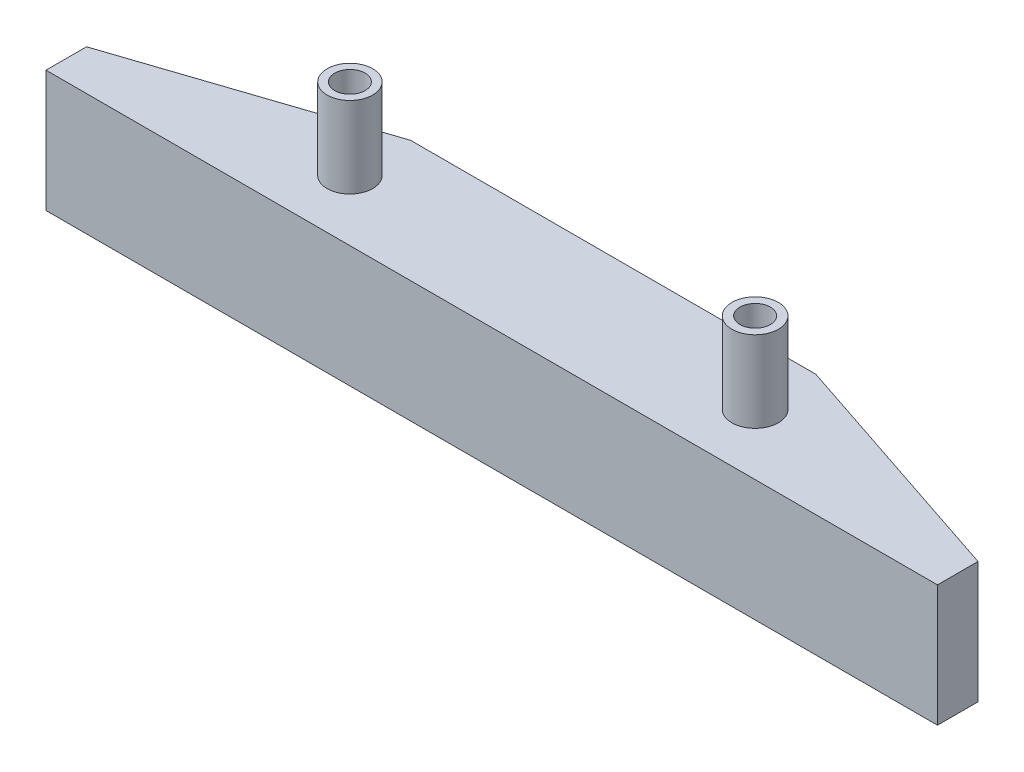
ISO-10303-21;
HEADER;
FILE_DESCRIPTION(('STEP AP214'),'2;1');
FILE_NAME('part.step','',(''),(''),'','','');
FILE_SCHEMA(('AUTOMOTIVE_DESIGN { 1 0 10303 214 1 1 1 1 }'));
ENDSEC;
DATA;
#1=APPLICATION_CONTEXT('core data for automotive mechanical design processes');
#2=APPLICATION_PROTOCOL_DEFINITION('international standard','automotive_design',2000,#1);
#3=PRODUCT_CONTEXT('',#1,'mechanical');
#4=PRODUCT('Part','Part','',(#3));
#5=PRODUCT_RELATED_PRODUCT_CATEGORY('part','',(#4));
#6=PRODUCT_DEFINITION_FORMATION('','',#4);
#7=PRODUCT_DEFINITION_CONTEXT('part definition',#1,'design');
#8=PRODUCT_DEFINITION('design','',#6,#7);
#9=PRODUCT_DEFINITION_SHAPE('','',#8);
#10=(LENGTH_UNIT() NAMED_UNIT(*) SI_UNIT(.MILLI.,.METRE.));
#11=(NAMED_UNIT(*) PLANE_ANGLE_UNIT() SI_UNIT($,.RADIAN.));
#12=(NAMED_UNIT(*) SI_UNIT($,.STERADIAN.) SOLID_ANGLE_UNIT());
#13=UNCERTAINTY_MEASURE_WITH_UNIT(LENGTH_MEASURE(1.E-05),#10,'distance_accuracy_value','');
#14=(GEOMETRIC_REPRESENTATION_CONTEXT(3) GLOBAL_UNCERTAINTY_ASSIGNED_CONTEXT((#13)) GLOBAL_UNIT_ASSIGNED_CONTEXT((#10,
#11,#12)) REPRESENTATION_CONTEXT('',''));
#15=CARTESIAN_POINT('',(0.,0.,0.));
#16=DIRECTION('',(0.,0.,1.));
#17=DIRECTION('',(1.,0.,0.));
#18=AXIS2_PLACEMENT_3D('',#15,#16,#17);
#19=CARTESIAN_POINT('',(0.,12.,0.));
#20=DIRECTION('',(0.,1.,0.));
#21=DIRECTION('',(0.,0.,1.));
#22=AXIS2_PLACEMENT_3D('',#19,#20,#21);
#23=PLANE('',#22);
#24=CARTESIAN_POINT('',(24.,12.,-5.99999999999996));
#25=DIRECTION('',(0.,1.,0.));
#26=DIRECTION('',(0.,0.,1.));
#27=AXIS2_PLACEMENT_3D('',#24,#25,#26);
#28=CIRCLE('',#27,2.25);
#29=CARTESIAN_POINT('',(24.,12.,-3.74999999999996));
#30=VERTEX_POINT('',#29);
#31=EDGE_CURVE('E234',#30,#30,#28,.T.);
#32=ORIENTED_EDGE('',*,*,#31,.F.);
#33=EDGE_LOOP('',(#32));
#34=FACE_BOUND('',#33,.T.);
#35=DIRECTION('',(0.,0.,1.));
#36=VECTOR('',#35,1.);
#37=CARTESIAN_POINT('',(0.,12.,-4.));
#38=LINE('',#37,#36);
#39=CARTESIAN_POINT('',(0.,12.,-4.));
#40=VERTEX_POINT('',#39);
#41=CARTESIAN_POINT('',(0.,12.,0.));
#42=VERTEX_POINT('',#41);
#43=EDGE_CURVE('E145',#40,#42,#38,.T.);
#44=ORIENTED_EDGE('',*,*,#43,.T.);
#45=DIRECTION('',(1.,0.,0.));
#46=VECTOR('',#45,1.);
#47=CARTESIAN_POINT('',(0.,12.,0.));
#48=LINE('',#47,#46);
#49=CARTESIAN_POINT('',(88.,12.,0.));
#50=VERTEX_POINT('',#49);
#51=EDGE_CURVE('E103',#42,#50,#48,.T.);
#52=ORIENTED_EDGE('',*,*,#51,.T.);
#53=DIRECTION('',(0.,0.,-1.));
#54=VECTOR('',#53,1.);
#55=CARTESIAN_POINT('',(88.,12.,0.));
#56=LINE('',#55,#54);
#57=CARTESIAN_POINT('',(88.,12.,-4.));
#58=VERTEX_POINT('',#57);
#59=EDGE_CURVE('E116',#50,#58,#56,.T.);
#60=ORIENTED_EDGE('',*,*,#59,.T.);
#61=DIRECTION('',(-0.948683298050514,0.,-0.316227766016838));
#62=VECTOR('',#61,1.);
#63=CARTESIAN_POINT('',(88.,12.,-4.));
#64=LINE('',#63,#62);
#65=CARTESIAN_POINT('',(64.,12.,-12.));
#66=VERTEX_POINT('',#65);
#67=EDGE_CURVE('E110',#58,#66,#64,.T.);
#68=ORIENTED_EDGE('',*,*,#67,.T.);
#69=DIRECTION('',(-1.,0.,0.));
#70=VECTOR('',#69,1.);
#71=CARTESIAN_POINT('',(64.,12.,-12.));
#72=LINE('',#71,#70);
#73=CARTESIAN_POINT('',(24.,12.,-12.));
#74=VERTEX_POINT('',#73);
#75=EDGE_CURVE('E114',#66,#74,#72,.T.);
#76=ORIENTED_EDGE('',*,*,#75,.T.);
#77=DIRECTION('',(-0.948683298050514,0.,0.316227766016838));
#78=VECTOR('',#77,1.);
#79=CARTESIAN_POINT('',(24.,12.,-12.));
#80=LINE('',#79,#78);
#81=EDGE_CURVE('E66',#74,#40,#80,.T.);
#82=ORIENTED_EDGE('',*,*,#81,.T.);
#83=EDGE_LOOP('',(#44,#52,#60,#68,#76,#82));
#84=FACE_BOUND('',#83,.T.);
#85=CARTESIAN_POINT('',(64.,12.,-5.99999999999996));
#86=DIRECTION('',(0.,1.,0.));
#87=DIRECTION('',(0.,0.,1.));
#88=AXIS2_PLACEMENT_3D('',#85,#86,#87);
#89=CIRCLE('',#88,2.29462250539894);
#90=CARTESIAN_POINT('',(64.,12.,-3.70537749460102));
#91=VERTEX_POINT('',#90);
#92=EDGE_CURVE('E224',#91,#91,#89,.T.);
#93=ORIENTED_EDGE('',*,*,#92,.F.);
#94=EDGE_LOOP('',(#93));
#95=FACE_BOUND('',#94,.T.);
#96=ADVANCED_FACE('F49',(#34,#84,#95),#23,.T.);
#97=CARTESIAN_POINT('',(0.,12.,-4.));
#98=DIRECTION('',(1.,0.,0.));
#99=DIRECTION('',(0.,0.,-1.));
#100=AXIS2_PLACEMENT_3D('',#97,#98,#99);
#101=PLANE('',#100);
#102=DIRECTION('',(0.,0.,1.));
#103=VECTOR('',#102,1.);
#104=CARTESIAN_POINT('',(0.,0.,-4.));
#105=LINE('',#104,#103);
#106=CARTESIAN_POINT('',(0.,0.,-4.));
#107=VERTEX_POINT('',#106);
#108=CARTESIAN_POINT('',(0.,0.,0.));
#109=VERTEX_POINT('',#108);
#110=EDGE_CURVE('E134',#107,#109,#105,.T.);
#111=ORIENTED_EDGE('',*,*,#110,.T.);
#112=DIRECTION('',(0.,-1.,0.));
#113=VECTOR('',#112,1.);
#114=CARTESIAN_POINT('',(0.,12.,0.));
#115=LINE('',#114,#113);
#116=EDGE_CURVE('E12',#42,#109,#115,.T.);
#117=ORIENTED_EDGE('',*,*,#116,.F.);
#118=ORIENTED_EDGE('',*,*,#43,.F.);
#119=DIRECTION('',(0.,-1.,0.));
#120=VECTOR('',#119,1.);
#121=CARTESIAN_POINT('',(0.,12.,-4.));
#122=LINE('',#121,#120);
#123=EDGE_CURVE('E130',#40,#107,#122,.T.);
#124=ORIENTED_EDGE('',*,*,#123,.T.);
#125=EDGE_LOOP('',(#111,#117,#118,#124));
#126=FACE_BOUND('',#125,.T.);
#127=ADVANCED_FACE('F51',(#126),#101,.F.);
#128=CARTESIAN_POINT('',(0.,12.,0.));
#129=DIRECTION('',(0.,0.,-1.));
#130=DIRECTION('',(-1.,0.,0.));
#131=AXIS2_PLACEMENT_3D('',#128,#129,#130);
#132=PLANE('',#131);
#133=DIRECTION('',(1.,0.,0.));
#134=VECTOR('',#133,1.);
#135=CARTESIAN_POINT('',(0.,0.,0.));
#136=LINE('',#135,#134);
#137=CARTESIAN_POINT('',(88.,0.,0.));
#138=VERTEX_POINT('',#137);
#139=EDGE_CURVE('E137',#109,#138,#136,.T.);
#140=ORIENTED_EDGE('',*,*,#139,.T.);
#141=DIRECTION('',(0.,-1.,0.));
#142=VECTOR('',#141,1.);
#143=CARTESIAN_POINT('',(88.,12.,0.));
#144=LINE('',#143,#142);
#145=EDGE_CURVE('E58',#50,#138,#144,.T.);
#146=ORIENTED_EDGE('',*,*,#145,.F.);
#147=ORIENTED_EDGE('',*,*,#51,.F.);
#148=ORIENTED_EDGE('',*,*,#116,.T.);
#149=EDGE_LOOP('',(#140,#146,#147,#148));
#150=FACE_BOUND('',#149,.T.);
#151=ADVANCED_FACE('F175',(#150),#132,.F.);
#152=CARTESIAN_POINT('',(88.,12.,0.));
#153=DIRECTION('',(-1.,0.,0.));
#154=DIRECTION('',(0.,0.,1.));
#155=AXIS2_PLACEMENT_3D('',#152,#153,#154);
#156=PLANE('',#155);
#157=DIRECTION('',(0.,0.,-1.));
#158=VECTOR('',#157,1.);
#159=CARTESIAN_POINT('',(88.,0.,0.));
#160=LINE('',#159,#158);
#161=CARTESIAN_POINT('',(88.,0.,-4.));
#162=VERTEX_POINT('',#161);
#163=EDGE_CURVE('E140',#138,#162,#160,.T.);
#164=ORIENTED_EDGE('',*,*,#163,.T.);
#165=DIRECTION('',(0.,-1.,0.));
#166=VECTOR('',#165,1.);
#167=CARTESIAN_POINT('',(88.,12.,-4.));
#168=LINE('',#167,#166);
#169=EDGE_CURVE('E125',#58,#162,#168,.T.);
#170=ORIENTED_EDGE('',*,*,#169,.F.);
#171=ORIENTED_EDGE('',*,*,#59,.F.);
#172=ORIENTED_EDGE('',*,*,#145,.T.);
#173=EDGE_LOOP('',(#164,#170,#171,#172));
#174=FACE_BOUND('',#173,.T.);
#175=ADVANCED_FACE('F151',(#174),#156,.F.);
#176=CARTESIAN_POINT('',(88.,12.,-4.));
#177=DIRECTION('',(-0.316227766016838,0.,0.948683298050514));
#178=DIRECTION('',(0.948683298050514,0.,0.316227766016838));
#179=AXIS2_PLACEMENT_3D('',#176,#177,#178);
#180=PLANE('',#179);
#181=DIRECTION('',(-0.948683298050514,0.,-0.316227766016838));
#182=VECTOR('',#181,1.);
#183=CARTESIAN_POINT('',(88.,0.,-4.));
#184=LINE('',#183,#182);
#185=CARTESIAN_POINT('',(64.,0.,-12.));
#186=VERTEX_POINT('',#185);
#187=EDGE_CURVE('E124',#162,#186,#184,.T.);
#188=ORIENTED_EDGE('',*,*,#187,.T.);
#189=DIRECTION('',(0.,-1.,0.));
#190=VECTOR('',#189,1.);
#191=CARTESIAN_POINT('',(64.,12.,-12.));
#192=LINE('',#191,#190);
#193=EDGE_CURVE('E121',#66,#186,#192,.T.);
#194=ORIENTED_EDGE('',*,*,#193,.F.);
#195=ORIENTED_EDGE('',*,*,#67,.F.);
#196=ORIENTED_EDGE('',*,*,#169,.T.);
#197=EDGE_LOOP('',(#188,#194,#195,#196));
#198=FACE_BOUND('',#197,.T.);
#199=ADVANCED_FACE('F122',(#198),#180,.F.);
#200=CARTESIAN_POINT('',(64.,12.,-12.));
#201=DIRECTION('',(0.,0.,1.));
#202=DIRECTION('',(1.,0.,0.));
#203=AXIS2_PLACEMENT_3D('',#200,#201,#202);
#204=PLANE('',#203);
#205=DIRECTION('',(-1.,0.,0.));
#206=VECTOR('',#205,1.);
#207=CARTESIAN_POINT('',(64.,0.,-12.));
#208=LINE('',#207,#206);
#209=CARTESIAN_POINT('',(24.,0.,-12.));
#210=VERTEX_POINT('',#209);
#211=EDGE_CURVE('E89',#186,#210,#208,.T.);
#212=ORIENTED_EDGE('',*,*,#211,.T.);
#213=DIRECTION('',(0.,-1.,0.));
#214=VECTOR('',#213,1.);
#215=CARTESIAN_POINT('',(24.,12.,-12.));
#216=LINE('',#215,#214);
#217=EDGE_CURVE('E126',#74,#210,#216,.T.);
#218=ORIENTED_EDGE('',*,*,#217,.F.);
#219=ORIENTED_EDGE('',*,*,#75,.F.);
#220=ORIENTED_EDGE('',*,*,#193,.T.);
#221=EDGE_LOOP('',(#212,#218,#219,#220));
#222=FACE_BOUND('',#221,.T.);
#223=ADVANCED_FACE('F128',(#222),#204,.F.);
#224=CARTESIAN_POINT('',(24.,12.,-12.));
#225=DIRECTION('',(0.316227766016838,0.,0.948683298050514));
#226=DIRECTION('',(0.948683298050514,0.,-0.316227766016838));
#227=AXIS2_PLACEMENT_3D('',#224,#225,#226);
#228=PLANE('',#227);
#229=DIRECTION('',(-0.948683298050514,0.,0.316227766016838));
#230=VECTOR('',#229,1.);
#231=CARTESIAN_POINT('',(24.,0.,-12.));
#232=LINE('',#231,#230);
#233=EDGE_CURVE('E95',#210,#107,#232,.T.);
#234=ORIENTED_EDGE('',*,*,#233,.T.);
#235=ORIENTED_EDGE('',*,*,#123,.F.);
#236=ORIENTED_EDGE('',*,*,#81,.F.);
#237=ORIENTED_EDGE('',*,*,#217,.T.);
#238=EDGE_LOOP('',(#234,#235,#236,#237));
#239=FACE_BOUND('',#238,.T.);
#240=ADVANCED_FACE('F158',(#239),#228,.F.);
#241=CARTESIAN_POINT('',(0.,0.,0.));
#242=DIRECTION('',(0.,1.,0.));
#243=DIRECTION('',(0.,0.,1.));
#244=AXIS2_PLACEMENT_3D('',#241,#242,#243);
#245=PLANE('',#244);
#246=CARTESIAN_POINT('',(24.,0.,-5.99999999999996));
#247=DIRECTION('',(0.,-1.,0.));
#248=DIRECTION('',(0.,0.,-1.));
#249=AXIS2_PLACEMENT_3D('',#246,#247,#248);
#250=CIRCLE('',#249,2.5);
#251=CARTESIAN_POINT('',(24.,0.,-8.49999999999996));
#252=VERTEX_POINT('',#251);
#253=EDGE_CURVE('E249',#252,#252,#250,.T.);
#254=ORIENTED_EDGE('',*,*,#253,.F.);
#255=EDGE_LOOP('',(#254));
#256=FACE_BOUND('',#255,.T.);
#257=CARTESIAN_POINT('',(64.,0.,-5.99999999999996));
#258=DIRECTION('',(0.,-1.,0.));
#259=DIRECTION('',(0.,0.,-1.));
#260=AXIS2_PLACEMENT_3D('',#257,#258,#259);
#261=CIRCLE('',#260,2.5);
#262=CARTESIAN_POINT('',(64.,0.,-8.49999999999996));
#263=VERTEX_POINT('',#262);
#264=EDGE_CURVE('E252',#263,#263,#261,.T.);
#265=ORIENTED_EDGE('',*,*,#264,.F.);
#266=EDGE_LOOP('',(#265));
#267=FACE_BOUND('',#266,.T.);
#268=ORIENTED_EDGE('',*,*,#110,.F.);
#269=ORIENTED_EDGE('',*,*,#233,.F.);
#270=ORIENTED_EDGE('',*,*,#211,.F.);
#271=ORIENTED_EDGE('',*,*,#187,.F.);
#272=ORIENTED_EDGE('',*,*,#163,.F.);
#273=ORIENTED_EDGE('',*,*,#139,.F.);
#274=EDGE_LOOP('',(#268,#269,#270,#271,#272,#273));
#275=FACE_BOUND('',#274,.T.);
#276=ADVANCED_FACE('F154',(#256,#267,#275),#245,.F.);
#277=CARTESIAN_POINT('',(64.,5.,-5.99999999999996));
#278=DIRECTION('',(0.,-1.,0.));
#279=DIRECTION('',(0.,0.,-1.));
#280=AXIS2_PLACEMENT_3D('',#277,#278,#279);
#281=CYLINDRICAL_SURFACE('',#280,2.5);
#282=CARTESIAN_POINT('',(64.,5.,-5.99999999999996));
#283=DIRECTION('',(0.,-1.,0.));
#284=DIRECTION('',(0.,0.,-1.));
#285=AXIS2_PLACEMENT_3D('',#282,#283,#284);
#286=CIRCLE('',#285,2.5);
#287=CARTESIAN_POINT('',(64.,5.,-8.49999999999996));
#288=VERTEX_POINT('',#287);
#289=EDGE_CURVE('E244',#288,#288,#286,.T.);
#290=ORIENTED_EDGE('',*,*,#289,.F.);
#291=EDGE_LOOP('',(#290));
#292=FACE_BOUND('',#291,.T.);
#293=ORIENTED_EDGE('',*,*,#264,.T.);
#294=EDGE_LOOP('',(#293));
#295=FACE_BOUND('',#294,.T.);
#296=ADVANCED_FACE('F165',(#292,#295),#281,.F.);
#297=CARTESIAN_POINT('',(64.,5.,-5.99999999999996));
#298=DIRECTION('',(0.,-1.,0.));
#299=DIRECTION('',(0.,0.,-1.));
#300=AXIS2_PLACEMENT_3D('',#297,#298,#299);
#301=PLANE('',#300);
#302=CARTESIAN_POINT('',(64.,5.,-5.99999999999996));
#303=DIRECTION('',(0.,-1.,0.));
#304=DIRECTION('',(0.,0.,-1.));
#305=AXIS2_PLACEMENT_3D('',#302,#303,#304);
#306=CIRCLE('',#305,1.5);
#307=CARTESIAN_POINT('',(64.,5.,-7.49999999999995));
#308=VERTEX_POINT('',#307);
#309=EDGE_CURVE('E238',#308,#308,#306,.T.);
#310=ORIENTED_EDGE('',*,*,#309,.F.);
#311=EDGE_LOOP('',(#310));
#312=FACE_BOUND('',#311,.T.);
#313=ORIENTED_EDGE('',*,*,#289,.T.);
#314=EDGE_LOOP('',(#313));
#315=FACE_BOUND('',#314,.T.);
#316=ADVANCED_FACE('F178',(#312,#315),#301,.T.);
#317=CARTESIAN_POINT('',(24.,5.,-5.99999999999996));
#318=DIRECTION('',(0.,-1.,0.));
#319=DIRECTION('',(0.,0.,-1.));
#320=AXIS2_PLACEMENT_3D('',#317,#318,#319);
#321=CYLINDRICAL_SURFACE('',#320,2.5);
#322=CARTESIAN_POINT('',(24.,5.,-5.99999999999996));
#323=DIRECTION('',(0.,-1.,0.));
#324=DIRECTION('',(0.,0.,-1.));
#325=AXIS2_PLACEMENT_3D('',#322,#323,#324);
#326=CIRCLE('',#325,2.5);
#327=CARTESIAN_POINT('',(24.,5.,-8.49999999999996));
#328=VERTEX_POINT('',#327);
#329=EDGE_CURVE('E138',#328,#328,#326,.T.);
#330=ORIENTED_EDGE('',*,*,#329,.F.);
#331=EDGE_LOOP('',(#330));
#332=FACE_BOUND('',#331,.T.);
#333=ORIENTED_EDGE('',*,*,#253,.T.);
#334=EDGE_LOOP('',(#333));
#335=FACE_BOUND('',#334,.T.);
#336=ADVANCED_FACE('F181',(#332,#335),#321,.F.);
#337=CARTESIAN_POINT('',(24.,5.,-5.99999999999996));
#338=DIRECTION('',(0.,-1.,0.));
#339=DIRECTION('',(0.,0.,-1.));
#340=AXIS2_PLACEMENT_3D('',#337,#338,#339);
#341=PLANE('',#340);
#342=CARTESIAN_POINT('',(24.,5.,-5.99999999999996));
#343=DIRECTION('',(0.,-1.,0.));
#344=DIRECTION('',(0.,0.,-1.));
#345=AXIS2_PLACEMENT_3D('',#342,#343,#344);
#346=CIRCLE('',#345,1.5);
#347=CARTESIAN_POINT('',(24.,5.,-7.49999999999996));
#348=VERTEX_POINT('',#347);
#349=EDGE_CURVE('E241',#348,#348,#346,.T.);
#350=ORIENTED_EDGE('',*,*,#349,.F.);
#351=EDGE_LOOP('',(#350));
#352=FACE_BOUND('',#351,.T.);
#353=ORIENTED_EDGE('',*,*,#329,.T.);
#354=EDGE_LOOP('',(#353));
#355=FACE_BOUND('',#354,.T.);
#356=ADVANCED_FACE('F188',(#352,#355),#341,.T.);
#357=CARTESIAN_POINT('',(64.,12.,-5.99999999999996));
#358=DIRECTION('',(0.,-1.,0.));
#359=DIRECTION('',(0.,0.,-1.));
#360=AXIS2_PLACEMENT_3D('',#357,#358,#359);
#361=CYLINDRICAL_SURFACE('',#360,1.5);
#362=ORIENTED_EDGE('',*,*,#309,.T.);
#363=EDGE_LOOP('',(#362));
#364=FACE_BOUND('',#363,.T.);
#365=CARTESIAN_POINT('',(64.,20.,-5.99999999999996));
#366=DIRECTION('',(0.,1.,0.));
#367=DIRECTION('',(0.,0.,1.));
#368=AXIS2_PLACEMENT_3D('',#365,#366,#367);
#369=CIRCLE('',#368,1.5);
#370=CARTESIAN_POINT('',(64.,20.,-4.49999999999996));
#371=VERTEX_POINT('',#370);
#372=EDGE_CURVE('E225',#371,#371,#369,.T.);
#373=ORIENTED_EDGE('',*,*,#372,.T.);
#374=EDGE_LOOP('',(#373));
#375=FACE_BOUND('',#374,.T.);
#376=ADVANCED_FACE('F192',(#364,#375),#361,.F.);
#377=CARTESIAN_POINT('',(24.,12.,-5.99999999999996));
#378=DIRECTION('',(0.,-1.,0.));
#379=DIRECTION('',(0.,0.,-1.));
#380=AXIS2_PLACEMENT_3D('',#377,#378,#379);
#381=CYLINDRICAL_SURFACE('',#380,1.5);
#382=ORIENTED_EDGE('',*,*,#349,.T.);
#383=EDGE_LOOP('',(#382));
#384=FACE_BOUND('',#383,.T.);
#385=CARTESIAN_POINT('',(24.,20.,-5.99999999999996));
#386=DIRECTION('',(0.,1.,0.));
#387=DIRECTION('',(0.,0.,1.));
#388=AXIS2_PLACEMENT_3D('',#385,#386,#387);
#389=CIRCLE('',#388,1.5);
#390=CARTESIAN_POINT('',(24.,20.,-4.49999999999996));
#391=VERTEX_POINT('',#390);
#392=EDGE_CURVE('E228',#391,#391,#389,.T.);
#393=ORIENTED_EDGE('',*,*,#392,.T.);
#394=EDGE_LOOP('',(#393));
#395=FACE_BOUND('',#394,.T.);
#396=ADVANCED_FACE('F196',(#384,#395),#381,.F.);
#397=CARTESIAN_POINT('',(24.,20.,-5.99999999999996));
#398=DIRECTION('',(0.,1.,0.));
#399=DIRECTION('',(0.,0.,1.));
#400=AXIS2_PLACEMENT_3D('',#397,#398,#399);
#401=PLANE('',#400);
#402=CARTESIAN_POINT('',(24.,20.,-5.99999999999996));
#403=DIRECTION('',(0.,1.,0.));
#404=DIRECTION('',(0.,0.,1.));
#405=AXIS2_PLACEMENT_3D('',#402,#403,#404);
#406=CIRCLE('',#405,2.25);
#407=CARTESIAN_POINT('',(24.,20.,-3.74999999999996));
#408=VERTEX_POINT('',#407);
#409=EDGE_CURVE('E235',#408,#408,#406,.T.);
#410=ORIENTED_EDGE('',*,*,#409,.T.);
#411=EDGE_LOOP('',(#410));
#412=FACE_BOUND('',#411,.T.);
#413=ORIENTED_EDGE('',*,*,#392,.F.);
#414=EDGE_LOOP('',(#413));
#415=FACE_BOUND('',#414,.T.);
#416=ADVANCED_FACE('F200',(#412,#415),#401,.T.);
#417=CARTESIAN_POINT('',(24.,20.,-5.99999999999996));
#418=DIRECTION('',(0.,-1.,0.));
#419=DIRECTION('',(0.,0.,-1.));
#420=AXIS2_PLACEMENT_3D('',#417,#418,#419);
#421=CYLINDRICAL_SURFACE('',#420,2.25);
#422=ORIENTED_EDGE('',*,*,#409,.F.);
#423=EDGE_LOOP('',(#422));
#424=FACE_BOUND('',#423,.T.);
#425=ORIENTED_EDGE('',*,*,#31,.T.);
#426=EDGE_LOOP('',(#425));
#427=FACE_BOUND('',#426,.T.);
#428=ADVANCED_FACE('F202',(#424,#427),#421,.T.);
#429=CARTESIAN_POINT('',(64.,20.,-5.99999999999996));
#430=DIRECTION('',(0.,1.,0.));
#431=DIRECTION('',(0.,0.,1.));
#432=AXIS2_PLACEMENT_3D('',#429,#430,#431);
#433=PLANE('',#432);
#434=CARTESIAN_POINT('',(64.,20.,-5.99999999999996));
#435=DIRECTION('',(0.,1.,0.));
#436=DIRECTION('',(0.,0.,1.));
#437=AXIS2_PLACEMENT_3D('',#434,#435,#436);
#438=CIRCLE('',#437,2.29462250539894);
#439=CARTESIAN_POINT('',(64.,20.,-3.70537749460102));
#440=VERTEX_POINT('',#439);
#441=EDGE_CURVE('E221',#440,#440,#438,.T.);
#442=ORIENTED_EDGE('',*,*,#441,.T.);
#443=EDGE_LOOP('',(#442));
#444=FACE_BOUND('',#443,.T.);
#445=ORIENTED_EDGE('',*,*,#372,.F.);
#446=EDGE_LOOP('',(#445));
#447=FACE_BOUND('',#446,.T.);
#448=ADVANCED_FACE('F205',(#444,#447),#433,.T.);
#449=CARTESIAN_POINT('',(64.,20.,-5.99999999999996));
#450=DIRECTION('',(0.,-1.,0.));
#451=DIRECTION('',(0.,0.,-1.));
#452=AXIS2_PLACEMENT_3D('',#449,#450,#451);
#453=CYLINDRICAL_SURFACE('',#452,2.29462250539894);
#454=ORIENTED_EDGE('',*,*,#441,.F.);
#455=EDGE_LOOP('',(#454));
#456=FACE_BOUND('',#455,.T.);
#457=ORIENTED_EDGE('',*,*,#92,.T.);
#458=EDGE_LOOP('',(#457));
#459=FACE_BOUND('',#458,.T.);
#460=ADVANCED_FACE('F212',(#456,#459),#453,.T.);
#461=CLOSED_SHELL('',(#96,#127,#151,#175,#199,#223,#240,#276,#296,#316,#336,#356,#376,#396,#416,
#428,#448,#460));
#462=MANIFOLD_SOLID_BREP('B2',#461);
#463=ADVANCED_BREP_SHAPE_REPRESENTATION('',(#18,#462),#14);
#464=SHAPE_DEFINITION_REPRESENTATION(#9,#463);
ENDSEC;
END-ISO-10303-21;
